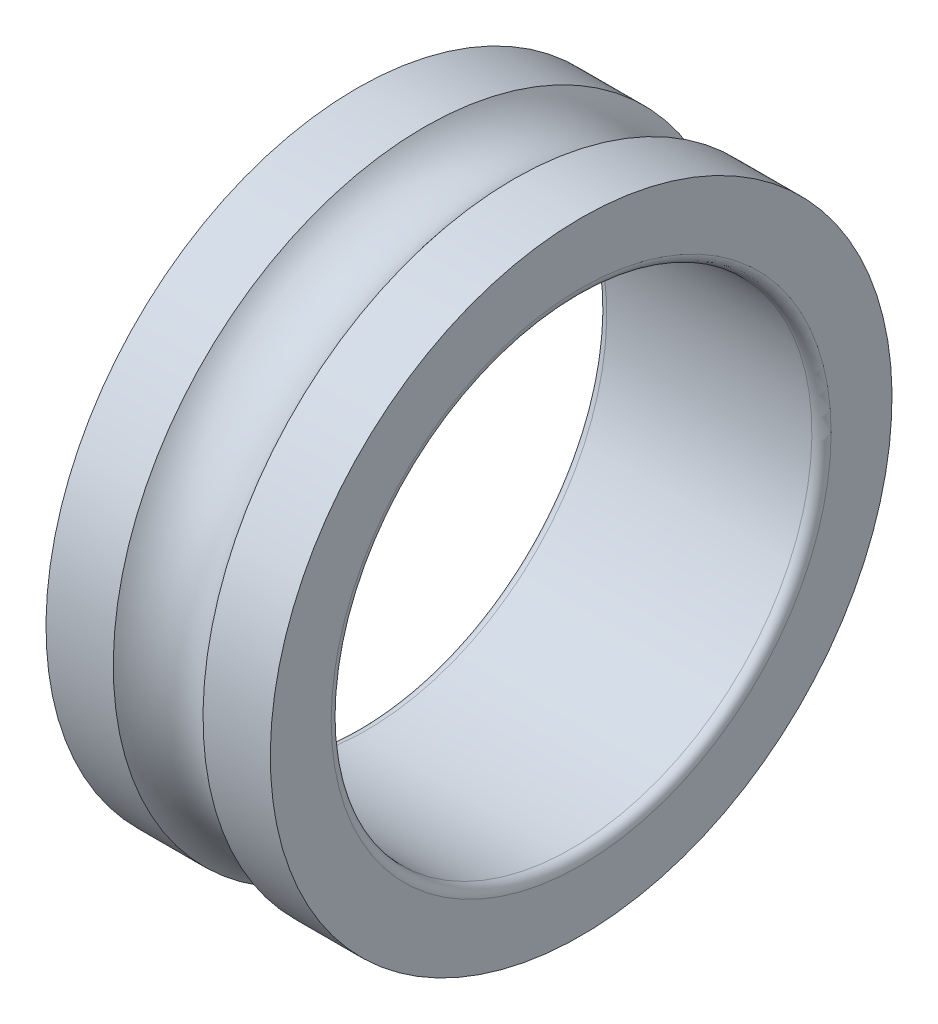
ISO-10303-21;
HEADER;
FILE_DESCRIPTION(('STEP AP214'),'2;1');
FILE_NAME('part.step','',(''),(''),'','','');
FILE_SCHEMA(('AUTOMOTIVE_DESIGN { 1 0 10303 214 1 1 1 1 }'));
ENDSEC;
DATA;
#1=APPLICATION_CONTEXT('core data for automotive mechanical design processes');
#2=APPLICATION_PROTOCOL_DEFINITION('international standard','automotive_design',2000,#1);
#3=PRODUCT_CONTEXT('',#1,'mechanical');
#4=PRODUCT('Part','Part','',(#3));
#5=PRODUCT_RELATED_PRODUCT_CATEGORY('part','',(#4));
#6=PRODUCT_DEFINITION_FORMATION('','',#4);
#7=PRODUCT_DEFINITION_CONTEXT('part definition',#1,'design');
#8=PRODUCT_DEFINITION('design','',#6,#7);
#9=PRODUCT_DEFINITION_SHAPE('','',#8);
#10=(LENGTH_UNIT() NAMED_UNIT(*) SI_UNIT(.MILLI.,.METRE.));
#11=(NAMED_UNIT(*) PLANE_ANGLE_UNIT() SI_UNIT($,.RADIAN.));
#12=(NAMED_UNIT(*) SI_UNIT($,.STERADIAN.) SOLID_ANGLE_UNIT());
#13=UNCERTAINTY_MEASURE_WITH_UNIT(LENGTH_MEASURE(1.E-05),#10,'distance_accuracy_value','');
#14=(GEOMETRIC_REPRESENTATION_CONTEXT(3) GLOBAL_UNCERTAINTY_ASSIGNED_CONTEXT((#13)) GLOBAL_UNIT_ASSIGNED_CONTEXT((#10,
#11,#12)) REPRESENTATION_CONTEXT('',''));
#15=CARTESIAN_POINT('',(0.,0.,0.));
#16=DIRECTION('',(0.,0.,1.));
#17=DIRECTION('',(1.,0.,0.));
#18=AXIS2_PLACEMENT_3D('',#15,#16,#17);
#19=CARTESIAN_POINT('',(5.95,0.,0.));
#20=DIRECTION('',(-1.,0.,0.));
#21=DIRECTION('',(0.,1.,0.));
#22=AXIS2_PLACEMENT_3D('',#19,#20,#21);
#23=CYLINDRICAL_SURFACE('',#22,9.7);
#24=CARTESIAN_POINT('',(4.9,0.,0.));
#25=DIRECTION('',(1.,0.,0.));
#26=DIRECTION('',(0.,1.,0.));
#27=AXIS2_PLACEMENT_3D('',#24,#25,#26);
#28=CIRCLE('',#27,9.7);
#29=CARTESIAN_POINT('',(4.9,9.7,0.));
#30=VERTEX_POINT('',#29);
#31=EDGE_CURVE('E11',#30,#30,#28,.T.);
#32=ORIENTED_EDGE('',*,*,#31,.T.);
#33=EDGE_LOOP('',(#32));
#34=FACE_BOUND('',#33,.T.);
#35=CARTESIAN_POINT('',(7.,0.,0.));
#36=DIRECTION('',(1.,0.,0.));
#37=DIRECTION('',(0.,1.,0.));
#38=AXIS2_PLACEMENT_3D('',#35,#36,#37);
#39=CIRCLE('',#38,9.7);
#40=CARTESIAN_POINT('',(7.,9.7,0.));
#41=VERTEX_POINT('',#40);
#42=EDGE_CURVE('E45',#41,#41,#39,.T.);
#43=ORIENTED_EDGE('',*,*,#42,.F.);
#44=EDGE_LOOP('',(#43));
#45=FACE_BOUND('',#44,.T.);
#46=ADVANCED_FACE('F16',(#34,#45),#23,.T.);
#47=CARTESIAN_POINT('',(3.5,0.,0.));
#48=DIRECTION('',(1.,0.,0.));
#49=DIRECTION('',(0.,0.,-1.));
#50=AXIS2_PLACEMENT_3D('',#47,#48,#49);
#51=TOROIDAL_SURFACE('',#50,10.75,1.75);
#52=CARTESIAN_POINT('',(2.1,0.,0.));
#53=DIRECTION('',(1.,0.,0.));
#54=DIRECTION('',(0.,1.,0.));
#55=AXIS2_PLACEMENT_3D('',#52,#53,#54);
#56=CIRCLE('',#55,9.7);
#57=CARTESIAN_POINT('',(2.1,9.7,0.));
#58=VERTEX_POINT('',#57);
#59=EDGE_CURVE('E26',#58,#58,#56,.T.);
#60=ORIENTED_EDGE('',*,*,#59,.T.);
#61=EDGE_LOOP('',(#60));
#62=FACE_BOUND('',#61,.T.);
#63=ORIENTED_EDGE('',*,*,#31,.F.);
#64=EDGE_LOOP('',(#63));
#65=FACE_BOUND('',#64,.T.);
#66=ADVANCED_FACE('F88',(#62,#65),#51,.F.);
#67=CARTESIAN_POINT('',(1.05,0.,0.));
#68=DIRECTION('',(-1.,0.,0.));
#69=DIRECTION('',(0.,1.,0.));
#70=AXIS2_PLACEMENT_3D('',#67,#68,#69);
#71=CYLINDRICAL_SURFACE('',#70,9.7);
#72=CARTESIAN_POINT('',(0.,0.,0.));
#73=DIRECTION('',(1.,0.,0.));
#74=DIRECTION('',(0.,1.,0.));
#75=AXIS2_PLACEMENT_3D('',#72,#73,#74);
#76=CIRCLE('',#75,9.7);
#77=CARTESIAN_POINT('',(0.,9.7,0.));
#78=VERTEX_POINT('',#77);
#79=EDGE_CURVE('E61',#78,#78,#76,.T.);
#80=ORIENTED_EDGE('',*,*,#79,.T.);
#81=EDGE_LOOP('',(#80));
#82=FACE_BOUND('',#81,.T.);
#83=ORIENTED_EDGE('',*,*,#59,.F.);
#84=EDGE_LOOP('',(#83));
#85=FACE_BOUND('',#84,.T.);
#86=ADVANCED_FACE('F74',(#82,#85),#71,.T.);
#87=CARTESIAN_POINT('',(0.,8.75,0.));
#88=DIRECTION('',(-1.,0.,0.));
#89=DIRECTION('',(0.,-1.,0.));
#90=AXIS2_PLACEMENT_3D('',#87,#88,#89);
#91=PLANE('',#90);
#92=CARTESIAN_POINT('',(0.,0.,0.));
#93=DIRECTION('',(1.,0.,0.));
#94=DIRECTION('',(0.,1.,0.));
#95=AXIS2_PLACEMENT_3D('',#92,#93,#94);
#96=CIRCLE('',#95,7.8);
#97=CARTESIAN_POINT('',(0.,7.8,0.));
#98=VERTEX_POINT('',#97);
#99=EDGE_CURVE('E59',#98,#98,#96,.T.);
#100=ORIENTED_EDGE('',*,*,#99,.T.);
#101=EDGE_LOOP('',(#100));
#102=FACE_BOUND('',#101,.T.);
#103=ORIENTED_EDGE('',*,*,#79,.F.);
#104=EDGE_LOOP('',(#103));
#105=FACE_BOUND('',#104,.T.);
#106=ADVANCED_FACE('F77',(#102,#105),#91,.T.);
#107=CARTESIAN_POINT('',(0.3,0.,0.));
#108=DIRECTION('',(1.,0.,0.));
#109=DIRECTION('',(0.,0.,-1.));
#110=AXIS2_PLACEMENT_3D('',#107,#108,#109);
#111=TOROIDAL_SURFACE('',#110,7.8,0.3);
#112=CARTESIAN_POINT('',(0.3,0.,0.));
#113=DIRECTION('',(1.,0.,0.));
#114=DIRECTION('',(0.,1.,0.));
#115=AXIS2_PLACEMENT_3D('',#112,#113,#114);
#116=CIRCLE('',#115,7.5);
#117=CARTESIAN_POINT('',(0.3,7.5,0.));
#118=VERTEX_POINT('',#117);
#119=EDGE_CURVE('E20',#118,#118,#116,.T.);
#120=ORIENTED_EDGE('',*,*,#119,.T.);
#121=EDGE_LOOP('',(#120));
#122=FACE_BOUND('',#121,.T.);
#123=ORIENTED_EDGE('',*,*,#99,.F.);
#124=EDGE_LOOP('',(#123));
#125=FACE_BOUND('',#124,.T.);
#126=ADVANCED_FACE('F56',(#122,#125),#111,.T.);
#127=CARTESIAN_POINT('',(3.5,0.,0.));
#128=DIRECTION('',(-1.,0.,0.));
#129=DIRECTION('',(0.,1.,0.));
#130=AXIS2_PLACEMENT_3D('',#127,#128,#129);
#131=CYLINDRICAL_SURFACE('',#130,7.5);
#132=CARTESIAN_POINT('',(6.7,0.,0.));
#133=DIRECTION('',(1.,0.,0.));
#134=DIRECTION('',(0.,1.,0.));
#135=AXIS2_PLACEMENT_3D('',#132,#133,#134);
#136=CIRCLE('',#135,7.5);
#137=CARTESIAN_POINT('',(6.7,7.5,0.));
#138=VERTEX_POINT('',#137);
#139=EDGE_CURVE('E60',#138,#138,#136,.T.);
#140=ORIENTED_EDGE('',*,*,#139,.T.);
#141=EDGE_LOOP('',(#140));
#142=FACE_BOUND('',#141,.T.);
#143=ORIENTED_EDGE('',*,*,#119,.F.);
#144=EDGE_LOOP('',(#143));
#145=FACE_BOUND('',#144,.T.);
#146=ADVANCED_FACE('F86',(#142,#145),#131,.F.);
#147=CARTESIAN_POINT('',(6.7,0.,0.));
#148=DIRECTION('',(1.,0.,0.));
#149=DIRECTION('',(0.,0.,-1.));
#150=AXIS2_PLACEMENT_3D('',#147,#148,#149);
#151=TOROIDAL_SURFACE('',#150,7.8,0.3);
#152=CARTESIAN_POINT('',(7.,0.,0.));
#153=DIRECTION('',(1.,0.,0.));
#154=DIRECTION('',(0.,1.,0.));
#155=AXIS2_PLACEMENT_3D('',#152,#153,#154);
#156=CIRCLE('',#155,7.8);
#157=CARTESIAN_POINT('',(7.,7.8,0.));
#158=VERTEX_POINT('',#157);
#159=EDGE_CURVE('E51',#158,#158,#156,.T.);
#160=ORIENTED_EDGE('',*,*,#159,.T.);
#161=EDGE_LOOP('',(#160));
#162=FACE_BOUND('',#161,.T.);
#163=ORIENTED_EDGE('',*,*,#139,.F.);
#164=EDGE_LOOP('',(#163));
#165=FACE_BOUND('',#164,.T.);
#166=ADVANCED_FACE('F18',(#162,#165),#151,.T.);
#167=CARTESIAN_POINT('',(7.,8.75,0.));
#168=DIRECTION('',(1.,0.,0.));
#169=DIRECTION('',(0.,1.,0.));
#170=AXIS2_PLACEMENT_3D('',#167,#168,#169);
#171=PLANE('',#170);
#172=ORIENTED_EDGE('',*,*,#42,.T.);
#173=EDGE_LOOP('',(#172));
#174=FACE_BOUND('',#173,.T.);
#175=ORIENTED_EDGE('',*,*,#159,.F.);
#176=EDGE_LOOP('',(#175));
#177=FACE_BOUND('',#176,.T.);
#178=ADVANCED_FACE('F97',(#174,#177),#171,.T.);
#179=CLOSED_SHELL('',(#46,#66,#86,#106,#126,#146,#166,#178));
#180=MANIFOLD_SOLID_BREP('B1',#179);
#181=ADVANCED_BREP_SHAPE_REPRESENTATION('',(#18,#180),#14);
#182=SHAPE_DEFINITION_REPRESENTATION(#9,#181);
ENDSEC;
END-ISO-10303-21;
